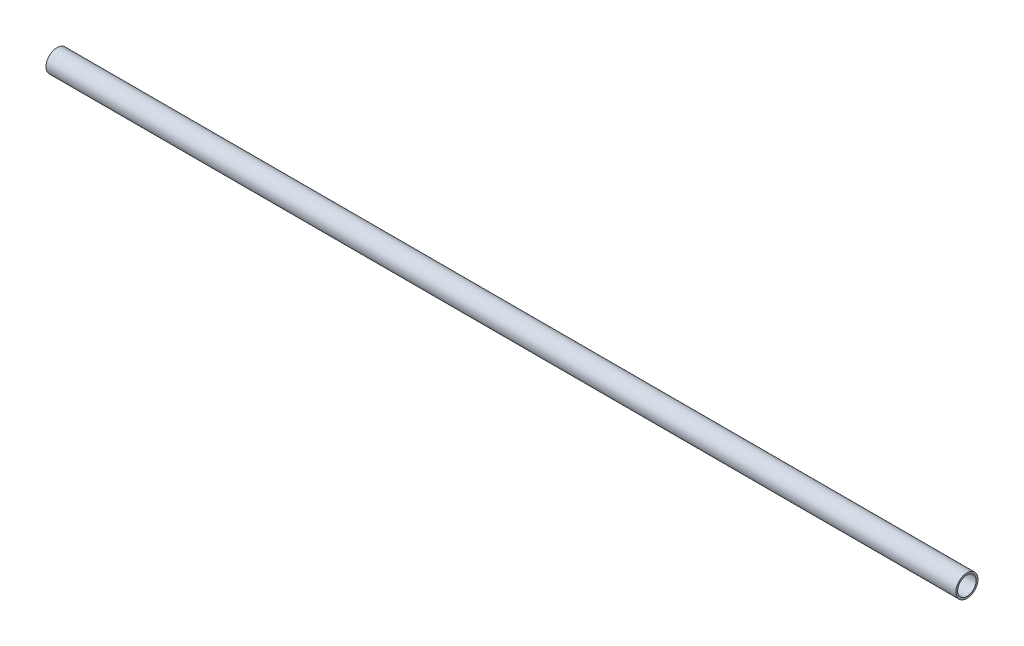
ISO-10303-21;
HEADER;
FILE_DESCRIPTION(('STEP AP214'),'2;1');
FILE_NAME('part.step','',(''),(''),'','','');
FILE_SCHEMA(('AUTOMOTIVE_DESIGN { 1 0 10303 214 1 1 1 1 }'));
ENDSEC;
DATA;
#1=APPLICATION_CONTEXT('core data for automotive mechanical design processes');
#2=APPLICATION_PROTOCOL_DEFINITION('international standard','automotive_design',2000,#1);
#3=PRODUCT_CONTEXT('',#1,'mechanical');
#4=PRODUCT('Part','Part','',(#3));
#5=PRODUCT_RELATED_PRODUCT_CATEGORY('part','',(#4));
#6=PRODUCT_DEFINITION_FORMATION('','',#4);
#7=PRODUCT_DEFINITION_CONTEXT('part definition',#1,'design');
#8=PRODUCT_DEFINITION('design','',#6,#7);
#9=PRODUCT_DEFINITION_SHAPE('','',#8);
#10=(LENGTH_UNIT() NAMED_UNIT(*) SI_UNIT(.MILLI.,.METRE.));
#11=(NAMED_UNIT(*) PLANE_ANGLE_UNIT() SI_UNIT($,.RADIAN.));
#12=(NAMED_UNIT(*) SI_UNIT($,.STERADIAN.) SOLID_ANGLE_UNIT());
#13=UNCERTAINTY_MEASURE_WITH_UNIT(LENGTH_MEASURE(1.E-05),#10,'distance_accuracy_value','');
#14=(GEOMETRIC_REPRESENTATION_CONTEXT(3) GLOBAL_UNCERTAINTY_ASSIGNED_CONTEXT((#13)) GLOBAL_UNIT_ASSIGNED_CONTEXT((#10,
#11,#12)) REPRESENTATION_CONTEXT('',''));
#15=CARTESIAN_POINT('',(0.,0.,0.));
#16=DIRECTION('',(0.,0.,1.));
#17=DIRECTION('',(1.,0.,0.));
#18=AXIS2_PLACEMENT_3D('',#15,#16,#17);
#19=CARTESIAN_POINT('',(1981.2,0.,0.));
#20=DIRECTION('',(1.,0.,0.));
#21=DIRECTION('',(0.,0.,-1.));
#22=AXIS2_PLACEMENT_3D('',#19,#20,#21);
#23=PLANE('',#22);
#24=CARTESIAN_POINT('',(1981.2,0.,0.));
#25=DIRECTION('',(1.,0.,0.));
#26=DIRECTION('',(0.,0.,-1.));
#27=AXIS2_PLACEMENT_3D('',#24,#25,#26);
#28=CIRCLE('',#27,24.13);
#29=CARTESIAN_POINT('',(1981.2,0.,-24.13));
#30=VERTEX_POINT('',#29);
#31=EDGE_CURVE('E12',#30,#30,#28,.T.);
#32=ORIENTED_EDGE('',*,*,#31,.T.);
#33=EDGE_LOOP('',(#32));
#34=FACE_BOUND('',#33,.T.);
#35=CARTESIAN_POINT('',(1981.2,0.,0.));
#36=DIRECTION('',(1.,0.,0.));
#37=DIRECTION('',(0.,0.,-1.));
#38=AXIS2_PLACEMENT_3D('',#35,#36,#37);
#39=CIRCLE('',#38,20.193);
#40=CARTESIAN_POINT('',(1981.2,0.,-20.193));
#41=VERTEX_POINT('',#40);
#42=EDGE_CURVE('E50',#41,#41,#39,.T.);
#43=ORIENTED_EDGE('',*,*,#42,.F.);
#44=EDGE_LOOP('',(#43));
#45=FACE_BOUND('',#44,.T.);
#46=ADVANCED_FACE('F39',(#34,#45),#23,.T.);
#47=CARTESIAN_POINT('',(0.,0.,0.));
#48=DIRECTION('',(1.,0.,0.));
#49=DIRECTION('',(0.,0.,-1.));
#50=AXIS2_PLACEMENT_3D('',#47,#48,#49);
#51=PLANE('',#50);
#52=CARTESIAN_POINT('',(0.,0.,0.));
#53=DIRECTION('',(1.,0.,0.));
#54=DIRECTION('',(0.,0.,-1.));
#55=AXIS2_PLACEMENT_3D('',#52,#53,#54);
#56=CIRCLE('',#55,24.13);
#57=CARTESIAN_POINT('',(0.,0.,-24.13));
#58=VERTEX_POINT('',#57);
#59=EDGE_CURVE('E43',#58,#58,#56,.T.);
#60=ORIENTED_EDGE('',*,*,#59,.F.);
#61=EDGE_LOOP('',(#60));
#62=FACE_BOUND('',#61,.T.);
#63=CARTESIAN_POINT('',(0.,0.,0.));
#64=DIRECTION('',(1.,0.,0.));
#65=DIRECTION('',(0.,0.,-1.));
#66=AXIS2_PLACEMENT_3D('',#63,#64,#65);
#67=CIRCLE('',#66,20.193);
#68=CARTESIAN_POINT('',(0.,0.,-20.193));
#69=VERTEX_POINT('',#68);
#70=EDGE_CURVE('E52',#69,#69,#67,.T.);
#71=ORIENTED_EDGE('',*,*,#70,.T.);
#72=EDGE_LOOP('',(#71));
#73=FACE_BOUND('',#72,.T.);
#74=ADVANCED_FACE('F62',(#62,#73),#51,.F.);
#75=CARTESIAN_POINT('',(1981.2,0.,0.));
#76=DIRECTION('',(-1.,0.,0.));
#77=DIRECTION('',(0.,0.,1.));
#78=AXIS2_PLACEMENT_3D('',#75,#76,#77);
#79=CYLINDRICAL_SURFACE('',#78,24.13);
#80=ORIENTED_EDGE('',*,*,#31,.F.);
#81=EDGE_LOOP('',(#80));
#82=FACE_BOUND('',#81,.T.);
#83=ORIENTED_EDGE('',*,*,#59,.T.);
#84=EDGE_LOOP('',(#83));
#85=FACE_BOUND('',#84,.T.);
#86=ADVANCED_FACE('F41',(#82,#85),#79,.T.);
#87=CARTESIAN_POINT('',(1981.2,0.,0.));
#88=DIRECTION('',(-1.,0.,0.));
#89=DIRECTION('',(0.,0.,1.));
#90=AXIS2_PLACEMENT_3D('',#87,#88,#89);
#91=CYLINDRICAL_SURFACE('',#90,20.193);
#92=ORIENTED_EDGE('',*,*,#42,.T.);
#93=EDGE_LOOP('',(#92));
#94=FACE_BOUND('',#93,.T.);
#95=ORIENTED_EDGE('',*,*,#70,.F.);
#96=EDGE_LOOP('',(#95));
#97=FACE_BOUND('',#96,.T.);
#98=ADVANCED_FACE('F58',(#94,#97),#91,.F.);
#99=CLOSED_SHELL('',(#46,#74,#86,#98));
#100=MANIFOLD_SOLID_BREP('B2',#99);
#101=ADVANCED_BREP_SHAPE_REPRESENTATION('',(#18,#100),#14);
#102=SHAPE_DEFINITION_REPRESENTATION(#9,#101);
ENDSEC;
END-ISO-10303-21;
